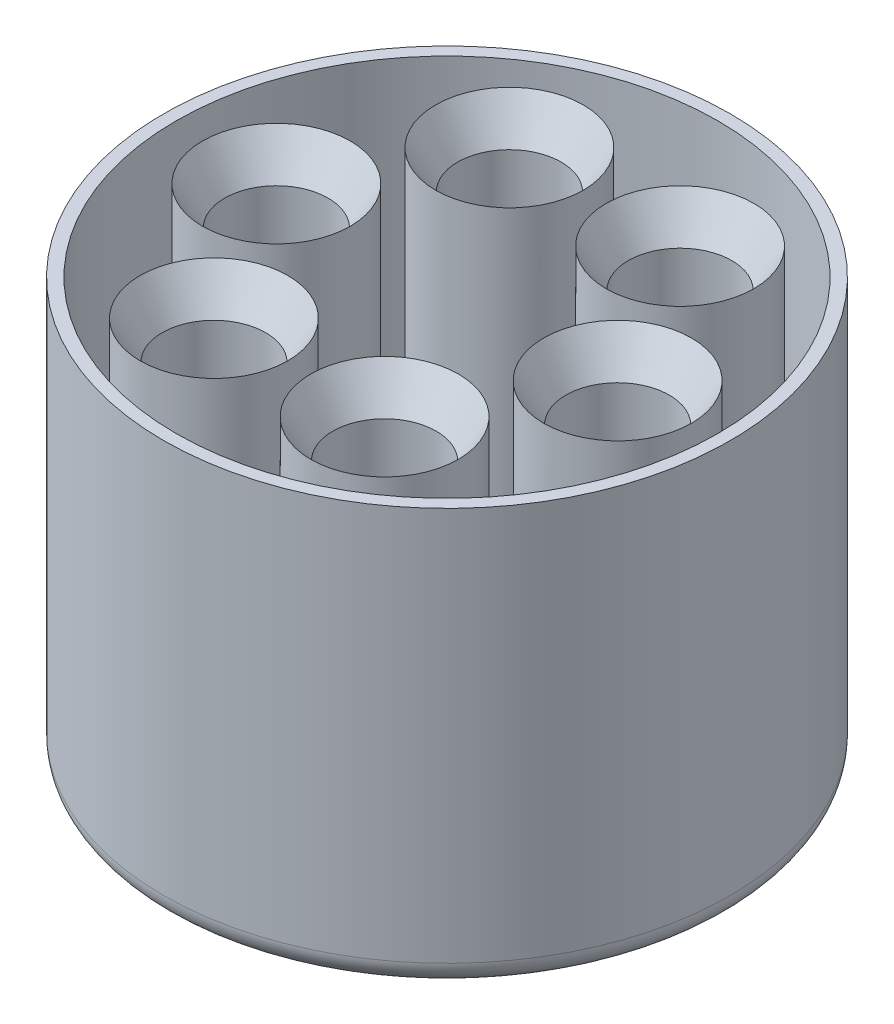
ISO-10303-21;
HEADER;
FILE_DESCRIPTION(('STEP AP214'),'2;1');
FILE_NAME('part.step','',(''),(''),'','','');
FILE_SCHEMA(('AUTOMOTIVE_DESIGN { 1 0 10303 214 1 1 1 1 }'));
ENDSEC;
DATA;
#1=APPLICATION_CONTEXT('core data for automotive mechanical design processes');
#2=APPLICATION_PROTOCOL_DEFINITION('international standard','automotive_design',2000,#1);
#3=PRODUCT_CONTEXT('',#1,'mechanical');
#4=PRODUCT('Part','Part','',(#3));
#5=PRODUCT_RELATED_PRODUCT_CATEGORY('part','',(#4));
#6=PRODUCT_DEFINITION_FORMATION('','',#4);
#7=PRODUCT_DEFINITION_CONTEXT('part definition',#1,'design');
#8=PRODUCT_DEFINITION('design','',#6,#7);
#9=PRODUCT_DEFINITION_SHAPE('','',#8);
#10=(LENGTH_UNIT() NAMED_UNIT(*) SI_UNIT(.MILLI.,.METRE.));
#11=(NAMED_UNIT(*) PLANE_ANGLE_UNIT() SI_UNIT($,.RADIAN.));
#12=(NAMED_UNIT(*) SI_UNIT($,.STERADIAN.) SOLID_ANGLE_UNIT());
#13=UNCERTAINTY_MEASURE_WITH_UNIT(LENGTH_MEASURE(1.E-05),#10,'distance_accuracy_value','');
#14=(GEOMETRIC_REPRESENTATION_CONTEXT(3) GLOBAL_UNCERTAINTY_ASSIGNED_CONTEXT((#13)) GLOBAL_UNIT_ASSIGNED_CONTEXT((#10,
#11,#12)) REPRESENTATION_CONTEXT('',''));
#15=CARTESIAN_POINT('',(0.,0.,0.));
#16=DIRECTION('',(0.,0.,1.));
#17=DIRECTION('',(1.,0.,0.));
#18=AXIS2_PLACEMENT_3D('',#15,#16,#17);
#19=CARTESIAN_POINT('',(0.,75.,0.));
#20=DIRECTION('',(0.,-1.,0.));
#21=DIRECTION('',(0.,0.,-1.));
#22=AXIS2_PLACEMENT_3D('',#19,#20,#21);
#23=CYLINDRICAL_SURFACE('',#22,55.);
#24=CARTESIAN_POINT('',(0.,75.,0.));
#25=DIRECTION('',(0.,1.,0.));
#26=DIRECTION('',(0.,0.,1.));
#27=AXIS2_PLACEMENT_3D('',#24,#25,#26);
#28=CIRCLE('',#27,55.);
#29=CARTESIAN_POINT('',(0.,75.,55.));
#30=VERTEX_POINT('',#29);
#31=EDGE_CURVE('E189',#30,#30,#28,.T.);
#32=ORIENTED_EDGE('',*,*,#31,.T.);
#33=EDGE_LOOP('',(#32));
#34=FACE_BOUND('',#33,.T.);
#35=CARTESIAN_POINT('',(0.,0.,0.));
#36=DIRECTION('',(0.,1.,0.));
#37=DIRECTION('',(0.,0.,1.));
#38=AXIS2_PLACEMENT_3D('',#35,#36,#37);
#39=CIRCLE('',#38,55.);
#40=CARTESIAN_POINT('',(0.,0.,55.));
#41=VERTEX_POINT('',#40);
#42=EDGE_CURVE('E183',#41,#41,#39,.T.);
#43=ORIENTED_EDGE('',*,*,#42,.F.);
#44=EDGE_LOOP('',(#43));
#45=FACE_BOUND('',#44,.T.);
#46=ADVANCED_FACE('F92',(#34,#45),#23,.F.);
#47=CARTESIAN_POINT('',(0.,75.,0.));
#48=DIRECTION('',(0.,-1.,0.));
#49=DIRECTION('',(0.,0.,-1.));
#50=AXIS2_PLACEMENT_3D('',#47,#48,#49);
#51=CYLINDRICAL_SURFACE('',#50,57.5);
#52=CARTESIAN_POINT('',(0.,-5.,0.));
#53=DIRECTION('',(0.,-1.,0.));
#54=DIRECTION('',(0.,0.,-1.));
#55=AXIS2_PLACEMENT_3D('',#52,#53,#54);
#56=CIRCLE('',#55,57.5);
#57=CARTESIAN_POINT('',(0.,-5.,-57.5));
#58=VERTEX_POINT('',#57);
#59=EDGE_CURVE('E11',#58,#58,#56,.F.);
#60=ORIENTED_EDGE('',*,*,#59,.T.);
#61=EDGE_LOOP('',(#60));
#62=FACE_BOUND('',#61,.T.);
#63=CARTESIAN_POINT('',(0.,75.,0.));
#64=DIRECTION('',(0.,1.,0.));
#65=DIRECTION('',(0.,0.,1.));
#66=AXIS2_PLACEMENT_3D('',#63,#64,#65);
#67=CIRCLE('',#66,57.5);
#68=CARTESIAN_POINT('',(0.,75.,57.5));
#69=VERTEX_POINT('',#68);
#70=EDGE_CURVE('E182',#69,#69,#67,.T.);
#71=ORIENTED_EDGE('',*,*,#70,.F.);
#72=EDGE_LOOP('',(#71));
#73=FACE_BOUND('',#72,.T.);
#74=ADVANCED_FACE('F237',(#62,#73),#51,.T.);
#75=CARTESIAN_POINT('',(0.,75.,0.));
#76=DIRECTION('',(0.,1.,0.));
#77=DIRECTION('',(0.,0.,1.));
#78=AXIS2_PLACEMENT_3D('',#75,#76,#77);
#79=PLANE('',#78);
#80=ORIENTED_EDGE('',*,*,#31,.F.);
#81=EDGE_LOOP('',(#80));
#82=FACE_BOUND('',#81,.T.);
#83=ORIENTED_EDGE('',*,*,#70,.T.);
#84=EDGE_LOOP('',(#83));
#85=FACE_BOUND('',#84,.T.);
#86=ADVANCED_FACE('F246',(#82,#85),#79,.T.);
#87=CARTESIAN_POINT('',(0.,0.,0.));
#88=DIRECTION('',(0.,-1.,0.));
#89=DIRECTION('',(0.,0.,-1.));
#90=AXIS2_PLACEMENT_3D('',#87,#88,#89);
#91=PLANE('',#90);
#92=CARTESIAN_POINT('',(17.3205080756888,0.,-30.));
#93=DIRECTION('',(0.,-1.,0.));
#94=DIRECTION('',(0.,0.,-1.));
#95=AXIS2_PLACEMENT_3D('',#92,#93,#94);
#96=CIRCLE('',#95,15.);
#97=CARTESIAN_POINT('',(17.3205080756888,0.,-45.));
#98=VERTEX_POINT('',#97);
#99=EDGE_CURVE('E159',#98,#98,#96,.F.);
#100=ORIENTED_EDGE('',*,*,#99,.F.);
#101=EDGE_LOOP('',(#100));
#102=FACE_BOUND('',#101,.T.);
#103=CARTESIAN_POINT('',(34.6410161513775,0.,0.));
#104=DIRECTION('',(0.,-1.,0.));
#105=DIRECTION('',(0.,0.,-1.));
#106=AXIS2_PLACEMENT_3D('',#103,#104,#105);
#107=CIRCLE('',#106,15.);
#108=CARTESIAN_POINT('',(34.6410161513775,0.,-15.));
#109=VERTEX_POINT('',#108);
#110=EDGE_CURVE('E161',#109,#109,#107,.F.);
#111=ORIENTED_EDGE('',*,*,#110,.F.);
#112=EDGE_LOOP('',(#111));
#113=FACE_BOUND('',#112,.T.);
#114=CARTESIAN_POINT('',(17.3205080756888,0.,30.));
#115=DIRECTION('',(0.,-1.,0.));
#116=DIRECTION('',(0.,0.,-1.));
#117=AXIS2_PLACEMENT_3D('',#114,#115,#116);
#118=CIRCLE('',#117,15.);
#119=CARTESIAN_POINT('',(17.3205080756888,0.,15.));
#120=VERTEX_POINT('',#119);
#121=EDGE_CURVE('E170',#120,#120,#118,.F.);
#122=ORIENTED_EDGE('',*,*,#121,.F.);
#123=EDGE_LOOP('',(#122));
#124=FACE_BOUND('',#123,.T.);
#125=CARTESIAN_POINT('',(-17.3205080756888,0.,30.));
#126=DIRECTION('',(0.,-1.,0.));
#127=DIRECTION('',(0.,0.,-1.));
#128=AXIS2_PLACEMENT_3D('',#125,#126,#127);
#129=CIRCLE('',#128,15.);
#130=CARTESIAN_POINT('',(-17.3205080756888,0.,15.));
#131=VERTEX_POINT('',#130);
#132=EDGE_CURVE('E171',#131,#131,#129,.F.);
#133=ORIENTED_EDGE('',*,*,#132,.F.);
#134=EDGE_LOOP('',(#133));
#135=FACE_BOUND('',#134,.T.);
#136=CARTESIAN_POINT('',(-17.3205080756888,0.,-30.));
#137=DIRECTION('',(0.,-1.,0.));
#138=DIRECTION('',(0.,0.,-1.));
#139=AXIS2_PLACEMENT_3D('',#136,#137,#138);
#140=CIRCLE('',#139,15.);
#141=CARTESIAN_POINT('',(-17.3205080756888,0.,-45.));
#142=VERTEX_POINT('',#141);
#143=EDGE_CURVE('E174',#142,#142,#140,.F.);
#144=ORIENTED_EDGE('',*,*,#143,.F.);
#145=EDGE_LOOP('',(#144));
#146=FACE_BOUND('',#145,.T.);
#147=CARTESIAN_POINT('',(-34.6410161513775,0.,0.));
#148=DIRECTION('',(0.,-1.,0.));
#149=DIRECTION('',(0.,0.,-1.));
#150=AXIS2_PLACEMENT_3D('',#147,#148,#149);
#151=CIRCLE('',#150,15.);
#152=CARTESIAN_POINT('',(-34.6410161513775,0.,-15.));
#153=VERTEX_POINT('',#152);
#154=EDGE_CURVE('E177',#153,#153,#151,.F.);
#155=ORIENTED_EDGE('',*,*,#154,.F.);
#156=EDGE_LOOP('',(#155));
#157=FACE_BOUND('',#156,.T.);
#158=ORIENTED_EDGE('',*,*,#42,.T.);
#159=EDGE_LOOP('',(#158));
#160=FACE_BOUND('',#159,.T.);
#161=ADVANCED_FACE('F232',(#102,#113,#124,#135,#146,#157,#160),#91,.F.);
#162=CARTESIAN_POINT('',(0.,-10.,0.));
#163=DIRECTION('',(0.,-1.,0.));
#164=DIRECTION('',(0.,0.,-1.));
#165=AXIS2_PLACEMENT_3D('',#162,#163,#164);
#166=PLANE('',#165);
#167=CARTESIAN_POINT('',(0.,-10.,0.));
#168=DIRECTION('',(0.,-1.,0.));
#169=DIRECTION('',(0.,0.,-1.));
#170=AXIS2_PLACEMENT_3D('',#167,#168,#169);
#171=CIRCLE('',#170,52.5);
#172=CARTESIAN_POINT('',(0.,-10.,-52.5));
#173=VERTEX_POINT('',#172);
#174=EDGE_CURVE('E101',#173,#173,#171,.T.);
#175=ORIENTED_EDGE('',*,*,#174,.T.);
#176=EDGE_LOOP('',(#175));
#177=FACE_BOUND('',#176,.T.);
#178=ADVANCED_FACE('F301',(#177),#166,.T.);
#179=CARTESIAN_POINT('',(-34.6410161513775,75.,0.));
#180=DIRECTION('',(0.,-1.,0.));
#181=DIRECTION('',(0.,0.,-1.));
#182=AXIS2_PLACEMENT_3D('',#179,#180,#181);
#183=CYLINDRICAL_SURFACE('',#182,15.);
#184=CARTESIAN_POINT('',(-34.6410161513775,74.1339745962154,0.));
#185=DIRECTION('',(0.,1.,0.));
#186=DIRECTION('',(0.,0.,1.));
#187=AXIS2_PLACEMENT_3D('',#184,#185,#186);
#188=CIRCLE('',#187,15.);
#189=CARTESIAN_POINT('',(-34.6410161513775,74.1339745962154,15.));
#190=VERTEX_POINT('',#189);
#191=EDGE_CURVE('E141',#190,#190,#188,.F.);
#192=ORIENTED_EDGE('',*,*,#191,.T.);
#193=EDGE_LOOP('',(#192));
#194=FACE_BOUND('',#193,.T.);
#195=ORIENTED_EDGE('',*,*,#154,.T.);
#196=EDGE_LOOP('',(#195));
#197=FACE_BOUND('',#196,.T.);
#198=ADVANCED_FACE('F314',(#194,#197),#183,.T.);
#199=CARTESIAN_POINT('',(-34.6410161513775,75.,0.));
#200=DIRECTION('',(0.,-1.,0.));
#201=DIRECTION('',(0.,0.,-1.));
#202=AXIS2_PLACEMENT_3D('',#199,#200,#201);
#203=CYLINDRICAL_SURFACE('',#202,10.5);
#204=CARTESIAN_POINT('',(-34.6410161513775,66.3397459621554,0.));
#205=DIRECTION('',(0.,1.,0.));
#206=DIRECTION('',(0.,0.,1.));
#207=AXIS2_PLACEMENT_3D('',#204,#205,#206);
#208=CIRCLE('',#207,10.5);
#209=CARTESIAN_POINT('',(-34.6410161513775,66.3397459621554,10.5));
#210=VERTEX_POINT('',#209);
#211=EDGE_CURVE('E150',#210,#210,#208,.T.);
#212=ORIENTED_EDGE('',*,*,#211,.T.);
#213=EDGE_LOOP('',(#212));
#214=FACE_BOUND('',#213,.T.);
#215=CARTESIAN_POINT('',(-34.6410161513775,0.,0.));
#216=DIRECTION('',(0.,1.,0.));
#217=DIRECTION('',(0.,0.,1.));
#218=AXIS2_PLACEMENT_3D('',#215,#216,#217);
#219=CIRCLE('',#218,10.5);
#220=CARTESIAN_POINT('',(-34.6410161513775,0.,10.5));
#221=VERTEX_POINT('',#220);
#222=EDGE_CURVE('E186',#221,#221,#219,.T.);
#223=ORIENTED_EDGE('',*,*,#222,.F.);
#224=EDGE_LOOP('',(#223));
#225=FACE_BOUND('',#224,.T.);
#226=ADVANCED_FACE('F320',(#214,#225),#203,.F.);
#227=ORIENTED_EDGE('',*,*,#222,.T.);
#228=EDGE_LOOP('',(#227));
#229=FACE_BOUND('',#228,.T.);
#230=ADVANCED_FACE('F305',(#229),#91,.F.);
#231=CARTESIAN_POINT('',(-17.3205080756888,75.,-30.));
#232=DIRECTION('',(0.,-1.,0.));
#233=DIRECTION('',(0.,0.,-1.));
#234=AXIS2_PLACEMENT_3D('',#231,#232,#233);
#235=CYLINDRICAL_SURFACE('',#234,10.5);
#236=CARTESIAN_POINT('',(-17.3205080756888,66.3397459621554,-30.));
#237=DIRECTION('',(0.,1.,0.));
#238=DIRECTION('',(0.,0.,1.));
#239=AXIS2_PLACEMENT_3D('',#236,#237,#238);
#240=CIRCLE('',#239,10.5);
#241=CARTESIAN_POINT('',(-17.3205080756888,66.3397459621554,-19.5));
#242=VERTEX_POINT('',#241);
#243=EDGE_CURVE('E154',#242,#242,#240,.T.);
#244=ORIENTED_EDGE('',*,*,#243,.T.);
#245=EDGE_LOOP('',(#244));
#246=FACE_BOUND('',#245,.T.);
#247=CARTESIAN_POINT('',(-17.3205080756888,0.,-30.));
#248=DIRECTION('',(0.,1.,0.));
#249=DIRECTION('',(0.,0.,1.));
#250=AXIS2_PLACEMENT_3D('',#247,#248,#249);
#251=CIRCLE('',#250,10.5);
#252=CARTESIAN_POINT('',(-17.3205080756888,0.,-19.5));
#253=VERTEX_POINT('',#252);
#254=EDGE_CURVE('E197',#253,#253,#251,.T.);
#255=ORIENTED_EDGE('',*,*,#254,.F.);
#256=EDGE_LOOP('',(#255));
#257=FACE_BOUND('',#256,.T.);
#258=ADVANCED_FACE('F353',(#246,#257),#235,.F.);
#259=CARTESIAN_POINT('',(-17.3205080756888,75.,-30.));
#260=DIRECTION('',(0.,-1.,0.));
#261=DIRECTION('',(0.,0.,-1.));
#262=AXIS2_PLACEMENT_3D('',#259,#260,#261);
#263=CYLINDRICAL_SURFACE('',#262,15.);
#264=CARTESIAN_POINT('',(-17.3205080756888,74.1339745962154,-30.));
#265=DIRECTION('',(0.,1.,0.));
#266=DIRECTION('',(0.,0.,1.));
#267=AXIS2_PLACEMENT_3D('',#264,#265,#266);
#268=CIRCLE('',#267,15.);
#269=CARTESIAN_POINT('',(-17.3205080756888,74.1339745962154,-15.));
#270=VERTEX_POINT('',#269);
#271=EDGE_CURVE('E153',#270,#270,#268,.F.);
#272=ORIENTED_EDGE('',*,*,#271,.T.);
#273=EDGE_LOOP('',(#272));
#274=FACE_BOUND('',#273,.T.);
#275=ORIENTED_EDGE('',*,*,#143,.T.);
#276=EDGE_LOOP('',(#275));
#277=FACE_BOUND('',#276,.T.);
#278=ADVANCED_FACE('F363',(#274,#277),#263,.T.);
#279=ORIENTED_EDGE('',*,*,#254,.T.);
#280=EDGE_LOOP('',(#279));
#281=FACE_BOUND('',#280,.T.);
#282=ADVANCED_FACE('F351',(#281),#91,.F.);
#283=CARTESIAN_POINT('',(-17.3205080756888,75.,30.));
#284=DIRECTION('',(0.,-1.,0.));
#285=DIRECTION('',(0.,0.,-1.));
#286=AXIS2_PLACEMENT_3D('',#283,#284,#285);
#287=CYLINDRICAL_SURFACE('',#286,15.);
#288=CARTESIAN_POINT('',(-17.3205080756888,74.1339745962154,30.));
#289=DIRECTION('',(0.,1.,0.));
#290=DIRECTION('',(0.,0.,1.));
#291=AXIS2_PLACEMENT_3D('',#288,#289,#290);
#292=CIRCLE('',#291,15.);
#293=CARTESIAN_POINT('',(-17.3205080756888,74.1339745962154,45.));
#294=VERTEX_POINT('',#293);
#295=EDGE_CURVE('E134',#294,#294,#292,.F.);
#296=ORIENTED_EDGE('',*,*,#295,.T.);
#297=EDGE_LOOP('',(#296));
#298=FACE_BOUND('',#297,.T.);
#299=ORIENTED_EDGE('',*,*,#132,.T.);
#300=EDGE_LOOP('',(#299));
#301=FACE_BOUND('',#300,.T.);
#302=ADVANCED_FACE('F359',(#298,#301),#287,.T.);
#303=CARTESIAN_POINT('',(-17.3205080756888,75.,30.));
#304=DIRECTION('',(0.,-1.,0.));
#305=DIRECTION('',(0.,0.,-1.));
#306=AXIS2_PLACEMENT_3D('',#303,#304,#305);
#307=CYLINDRICAL_SURFACE('',#306,10.5);
#308=CARTESIAN_POINT('',(-17.3205080756888,66.3397459621554,30.));
#309=DIRECTION('',(0.,1.,0.));
#310=DIRECTION('',(0.,0.,1.));
#311=AXIS2_PLACEMENT_3D('',#308,#309,#310);
#312=CIRCLE('',#311,10.5);
#313=CARTESIAN_POINT('',(-17.3205080756888,66.3397459621554,40.5));
#314=VERTEX_POINT('',#313);
#315=EDGE_CURVE('E139',#314,#314,#312,.T.);
#316=ORIENTED_EDGE('',*,*,#315,.T.);
#317=EDGE_LOOP('',(#316));
#318=FACE_BOUND('',#317,.T.);
#319=CARTESIAN_POINT('',(-17.3205080756888,0.,30.));
#320=DIRECTION('',(0.,1.,0.));
#321=DIRECTION('',(0.,0.,1.));
#322=AXIS2_PLACEMENT_3D('',#319,#320,#321);
#323=CIRCLE('',#322,10.5);
#324=CARTESIAN_POINT('',(-17.3205080756888,0.,40.5));
#325=VERTEX_POINT('',#324);
#326=EDGE_CURVE('E201',#325,#325,#323,.T.);
#327=ORIENTED_EDGE('',*,*,#326,.F.);
#328=EDGE_LOOP('',(#327));
#329=FACE_BOUND('',#328,.T.);
#330=ADVANCED_FACE('F371',(#318,#329),#307,.F.);
#331=ORIENTED_EDGE('',*,*,#326,.T.);
#332=EDGE_LOOP('',(#331));
#333=FACE_BOUND('',#332,.T.);
#334=ADVANCED_FACE('F361',(#333),#91,.F.);
#335=CARTESIAN_POINT('',(17.3205080756888,75.,30.));
#336=DIRECTION('',(0.,-1.,0.));
#337=DIRECTION('',(0.,0.,-1.));
#338=AXIS2_PLACEMENT_3D('',#335,#336,#337);
#339=CYLINDRICAL_SURFACE('',#338,15.);
#340=CARTESIAN_POINT('',(17.3205080756888,74.1339745962154,30.));
#341=DIRECTION('',(0.,1.,0.));
#342=DIRECTION('',(0.,0.,1.));
#343=AXIS2_PLACEMENT_3D('',#340,#341,#342);
#344=CIRCLE('',#343,15.);
#345=CARTESIAN_POINT('',(17.3205080756888,74.1339745962154,45.));
#346=VERTEX_POINT('',#345);
#347=EDGE_CURVE('E130',#346,#346,#344,.F.);
#348=ORIENTED_EDGE('',*,*,#347,.T.);
#349=EDGE_LOOP('',(#348));
#350=FACE_BOUND('',#349,.T.);
#351=ORIENTED_EDGE('',*,*,#121,.T.);
#352=EDGE_LOOP('',(#351));
#353=FACE_BOUND('',#352,.T.);
#354=ADVANCED_FACE('F369',(#350,#353),#339,.T.);
#355=CARTESIAN_POINT('',(17.3205080756888,75.,30.));
#356=DIRECTION('',(0.,-1.,0.));
#357=DIRECTION('',(0.,0.,-1.));
#358=AXIS2_PLACEMENT_3D('',#355,#356,#357);
#359=CYLINDRICAL_SURFACE('',#358,10.5);
#360=CARTESIAN_POINT('',(17.3205080756888,66.3397459621554,30.));
#361=DIRECTION('',(0.,1.,0.));
#362=DIRECTION('',(0.,0.,1.));
#363=AXIS2_PLACEMENT_3D('',#360,#361,#362);
#364=CIRCLE('',#363,10.5);
#365=CARTESIAN_POINT('',(17.3205080756888,66.3397459621554,40.5));
#366=VERTEX_POINT('',#365);
#367=EDGE_CURVE('E133',#366,#366,#364,.T.);
#368=ORIENTED_EDGE('',*,*,#367,.T.);
#369=EDGE_LOOP('',(#368));
#370=FACE_BOUND('',#369,.T.);
#371=CARTESIAN_POINT('',(17.3205080756888,0.,30.));
#372=DIRECTION('',(0.,1.,0.));
#373=DIRECTION('',(0.,0.,1.));
#374=AXIS2_PLACEMENT_3D('',#371,#372,#373);
#375=CIRCLE('',#374,10.5);
#376=CARTESIAN_POINT('',(17.3205080756888,0.,40.5));
#377=VERTEX_POINT('',#376);
#378=EDGE_CURVE('E210',#377,#377,#375,.T.);
#379=ORIENTED_EDGE('',*,*,#378,.F.);
#380=EDGE_LOOP('',(#379));
#381=FACE_BOUND('',#380,.T.);
#382=ADVANCED_FACE('F382',(#370,#381),#359,.F.);
#383=ORIENTED_EDGE('',*,*,#378,.T.);
#384=EDGE_LOOP('',(#383));
#385=FACE_BOUND('',#384,.T.);
#386=ADVANCED_FACE('F373',(#385),#91,.F.);
#387=CARTESIAN_POINT('',(34.6410161513775,75.,0.));
#388=DIRECTION('',(0.,-1.,0.));
#389=DIRECTION('',(0.,0.,-1.));
#390=AXIS2_PLACEMENT_3D('',#387,#388,#389);
#391=CYLINDRICAL_SURFACE('',#390,15.);
#392=CARTESIAN_POINT('',(34.6410161513775,74.1339745962155,0.));
#393=DIRECTION('',(0.,1.,0.));
#394=DIRECTION('',(0.,0.,1.));
#395=AXIS2_PLACEMENT_3D('',#392,#393,#394);
#396=CIRCLE('',#395,15.);
#397=CARTESIAN_POINT('',(34.6410161513775,74.1339745962155,15.));
#398=VERTEX_POINT('',#397);
#399=EDGE_CURVE('E118',#398,#398,#396,.F.);
#400=ORIENTED_EDGE('',*,*,#399,.T.);
#401=EDGE_LOOP('',(#400));
#402=FACE_BOUND('',#401,.T.);
#403=ORIENTED_EDGE('',*,*,#110,.T.);
#404=EDGE_LOOP('',(#403));
#405=FACE_BOUND('',#404,.T.);
#406=ADVANCED_FACE('F379',(#402,#405),#391,.T.);
#407=CARTESIAN_POINT('',(34.6410161513775,75.,0.));
#408=DIRECTION('',(0.,-1.,0.));
#409=DIRECTION('',(0.,0.,-1.));
#410=AXIS2_PLACEMENT_3D('',#407,#408,#409);
#411=CYLINDRICAL_SURFACE('',#410,10.5);
#412=CARTESIAN_POINT('',(34.6410161513775,66.3397459621554,0.));
#413=DIRECTION('',(0.,1.,0.));
#414=DIRECTION('',(0.,0.,1.));
#415=AXIS2_PLACEMENT_3D('',#412,#413,#414);
#416=CIRCLE('',#415,10.5);
#417=CARTESIAN_POINT('',(34.6410161513775,66.3397459621554,10.5));
#418=VERTEX_POINT('',#417);
#419=EDGE_CURVE('E124',#418,#418,#416,.T.);
#420=ORIENTED_EDGE('',*,*,#419,.T.);
#421=EDGE_LOOP('',(#420));
#422=FACE_BOUND('',#421,.T.);
#423=CARTESIAN_POINT('',(34.6410161513775,0.,0.));
#424=DIRECTION('',(0.,1.,0.));
#425=DIRECTION('',(0.,0.,1.));
#426=AXIS2_PLACEMENT_3D('',#423,#424,#425);
#427=CIRCLE('',#426,10.5);
#428=CARTESIAN_POINT('',(34.6410161513775,0.,10.5));
#429=VERTEX_POINT('',#428);
#430=EDGE_CURVE('E212',#429,#429,#427,.T.);
#431=ORIENTED_EDGE('',*,*,#430,.F.);
#432=EDGE_LOOP('',(#431));
#433=FACE_BOUND('',#432,.T.);
#434=ADVANCED_FACE('F389',(#422,#433),#411,.F.);
#435=ORIENTED_EDGE('',*,*,#430,.T.);
#436=EDGE_LOOP('',(#435));
#437=FACE_BOUND('',#436,.T.);
#438=ADVANCED_FACE('F234',(#437),#91,.F.);
#439=CARTESIAN_POINT('',(17.3205080756888,75.,-30.));
#440=DIRECTION('',(0.,-1.,0.));
#441=DIRECTION('',(0.,0.,-1.));
#442=AXIS2_PLACEMENT_3D('',#439,#440,#441);
#443=CYLINDRICAL_SURFACE('',#442,15.);
#444=CARTESIAN_POINT('',(17.3205080756888,74.1339745962154,-30.));
#445=DIRECTION('',(0.,1.,0.));
#446=DIRECTION('',(0.,0.,1.));
#447=AXIS2_PLACEMENT_3D('',#444,#445,#446);
#448=CIRCLE('',#447,15.);
#449=CARTESIAN_POINT('',(17.3205080756888,74.1339745962154,-15.));
#450=VERTEX_POINT('',#449);
#451=EDGE_CURVE('E108',#450,#450,#448,.F.);
#452=ORIENTED_EDGE('',*,*,#451,.T.);
#453=EDGE_LOOP('',(#452));
#454=FACE_BOUND('',#453,.T.);
#455=ORIENTED_EDGE('',*,*,#99,.T.);
#456=EDGE_LOOP('',(#455));
#457=FACE_BOUND('',#456,.T.);
#458=ADVANCED_FACE('F224',(#454,#457),#443,.T.);
#459=CARTESIAN_POINT('',(17.3205080756888,75.,-30.));
#460=DIRECTION('',(0.,-1.,0.));
#461=DIRECTION('',(0.,0.,-1.));
#462=AXIS2_PLACEMENT_3D('',#459,#460,#461);
#463=CYLINDRICAL_SURFACE('',#462,10.5);
#464=CARTESIAN_POINT('',(17.3205080756888,66.3397459621554,-30.));
#465=DIRECTION('',(0.,1.,0.));
#466=DIRECTION('',(0.,0.,1.));
#467=AXIS2_PLACEMENT_3D('',#464,#465,#466);
#468=CIRCLE('',#467,10.5);
#469=CARTESIAN_POINT('',(17.3205080756888,66.3397459621554,-19.5));
#470=VERTEX_POINT('',#469);
#471=EDGE_CURVE('E113',#470,#470,#468,.T.);
#472=ORIENTED_EDGE('',*,*,#471,.T.);
#473=EDGE_LOOP('',(#472));
#474=FACE_BOUND('',#473,.T.);
#475=CARTESIAN_POINT('',(17.3205080756888,0.,-30.));
#476=DIRECTION('',(0.,1.,0.));
#477=DIRECTION('',(0.,0.,1.));
#478=AXIS2_PLACEMENT_3D('',#475,#476,#477);
#479=CIRCLE('',#478,10.5);
#480=CARTESIAN_POINT('',(17.3205080756888,0.,-19.5));
#481=VERTEX_POINT('',#480);
#482=EDGE_CURVE('E213',#481,#481,#479,.T.);
#483=ORIENTED_EDGE('',*,*,#482,.F.);
#484=EDGE_LOOP('',(#483));
#485=FACE_BOUND('',#484,.T.);
#486=ADVANCED_FACE('F225',(#474,#485),#463,.F.);
#487=ORIENTED_EDGE('',*,*,#482,.T.);
#488=EDGE_LOOP('',(#487));
#489=FACE_BOUND('',#488,.T.);
#490=ADVANCED_FACE('F219',(#489),#91,.F.);
#491=CARTESIAN_POINT('',(-17.3205080756888,66.3397459621554,-30.));
#492=DIRECTION('',(0.,1.,0.));
#493=DIRECTION('',(0.,0.,1.));
#494=AXIS2_PLACEMENT_3D('',#491,#492,#493);
#495=CONICAL_SURFACE('',#494,10.5,0.523598775598295);
#496=ORIENTED_EDGE('',*,*,#271,.F.);
#497=EDGE_LOOP('',(#496));
#498=FACE_BOUND('',#497,.T.);
#499=ORIENTED_EDGE('',*,*,#243,.F.);
#500=EDGE_LOOP('',(#499));
#501=FACE_BOUND('',#500,.T.);
#502=ADVANCED_FACE('F235',(#498,#501),#495,.F.);
#503=CARTESIAN_POINT('',(-34.6410161513775,66.3397459621554,0.));
#504=DIRECTION('',(0.,1.,0.));
#505=DIRECTION('',(0.,0.,1.));
#506=AXIS2_PLACEMENT_3D('',#503,#504,#505);
#507=CONICAL_SURFACE('',#506,10.5,0.523598775598294);
#508=ORIENTED_EDGE('',*,*,#191,.F.);
#509=EDGE_LOOP('',(#508));
#510=FACE_BOUND('',#509,.T.);
#511=ORIENTED_EDGE('',*,*,#211,.F.);
#512=EDGE_LOOP('',(#511));
#513=FACE_BOUND('',#512,.T.);
#514=ADVANCED_FACE('F257',(#510,#513),#507,.F.);
#515=CARTESIAN_POINT('',(-17.3205080756888,66.3397459621554,30.));
#516=DIRECTION('',(0.,1.,0.));
#517=DIRECTION('',(0.,0.,1.));
#518=AXIS2_PLACEMENT_3D('',#515,#516,#517);
#519=CONICAL_SURFACE('',#518,10.5,0.523598775598294);
#520=ORIENTED_EDGE('',*,*,#295,.F.);
#521=EDGE_LOOP('',(#520));
#522=FACE_BOUND('',#521,.T.);
#523=ORIENTED_EDGE('',*,*,#315,.F.);
#524=EDGE_LOOP('',(#523));
#525=FACE_BOUND('',#524,.T.);
#526=ADVANCED_FACE('F261',(#522,#525),#519,.F.);
#527=CARTESIAN_POINT('',(17.3205080756888,66.3397459621554,30.));
#528=DIRECTION('',(0.,1.,0.));
#529=DIRECTION('',(0.,0.,1.));
#530=AXIS2_PLACEMENT_3D('',#527,#528,#529);
#531=CONICAL_SURFACE('',#530,10.5,0.523598775598294);
#532=ORIENTED_EDGE('',*,*,#347,.F.);
#533=EDGE_LOOP('',(#532));
#534=FACE_BOUND('',#533,.T.);
#535=ORIENTED_EDGE('',*,*,#367,.F.);
#536=EDGE_LOOP('',(#535));
#537=FACE_BOUND('',#536,.T.);
#538=ADVANCED_FACE('F267',(#534,#537),#531,.F.);
#539=CARTESIAN_POINT('',(34.6410161513775,66.3397459621554,0.));
#540=DIRECTION('',(0.,1.,0.));
#541=DIRECTION('',(0.,0.,1.));
#542=AXIS2_PLACEMENT_3D('',#539,#540,#541);
#543=CONICAL_SURFACE('',#542,10.5,0.523598775598294);
#544=ORIENTED_EDGE('',*,*,#399,.F.);
#545=EDGE_LOOP('',(#544));
#546=FACE_BOUND('',#545,.T.);
#547=ORIENTED_EDGE('',*,*,#419,.F.);
#548=EDGE_LOOP('',(#547));
#549=FACE_BOUND('',#548,.T.);
#550=ADVANCED_FACE('F280',(#546,#549),#543,.F.);
#551=CARTESIAN_POINT('',(17.3205080756888,66.3397459621554,-30.));
#552=DIRECTION('',(0.,1.,0.));
#553=DIRECTION('',(0.,0.,1.));
#554=AXIS2_PLACEMENT_3D('',#551,#552,#553);
#555=CONICAL_SURFACE('',#554,10.5,0.523598775598294);
#556=ORIENTED_EDGE('',*,*,#451,.F.);
#557=EDGE_LOOP('',(#556));
#558=FACE_BOUND('',#557,.T.);
#559=ORIENTED_EDGE('',*,*,#471,.F.);
#560=EDGE_LOOP('',(#559));
#561=FACE_BOUND('',#560,.T.);
#562=ADVANCED_FACE('F281',(#558,#561),#555,.F.);
#563=CARTESIAN_POINT('',(0.,-5.,0.));
#564=DIRECTION('',(0.,-1.,0.));
#565=DIRECTION('',(0.,0.,-1.));
#566=AXIS2_PLACEMENT_3D('',#563,#564,#565);
#567=TOROIDAL_SURFACE('',#566,52.5,5.);
#568=ORIENTED_EDGE('',*,*,#59,.F.);
#569=EDGE_LOOP('',(#568));
#570=FACE_BOUND('',#569,.T.);
#571=ORIENTED_EDGE('',*,*,#174,.F.);
#572=EDGE_LOOP('',(#571));
#573=FACE_BOUND('',#572,.T.);
#574=ADVANCED_FACE('F97',(#570,#573),#567,.T.);
#575=CLOSED_SHELL('',(#46,#74,#86,#161,#178,#198,#226,#230,#258,#278,#282,#302,#330,#334,#354,
#382,#386,#406,#434,#438,#458,#486,#490,#502,#514,#526,#538,#550,#562,#574));
#576=MANIFOLD_SOLID_BREP('B2',#575);
#577=ADVANCED_BREP_SHAPE_REPRESENTATION('',(#18,#576),#14);
#578=SHAPE_DEFINITION_REPRESENTATION(#9,#577);
ENDSEC;
END-ISO-10303-21;
